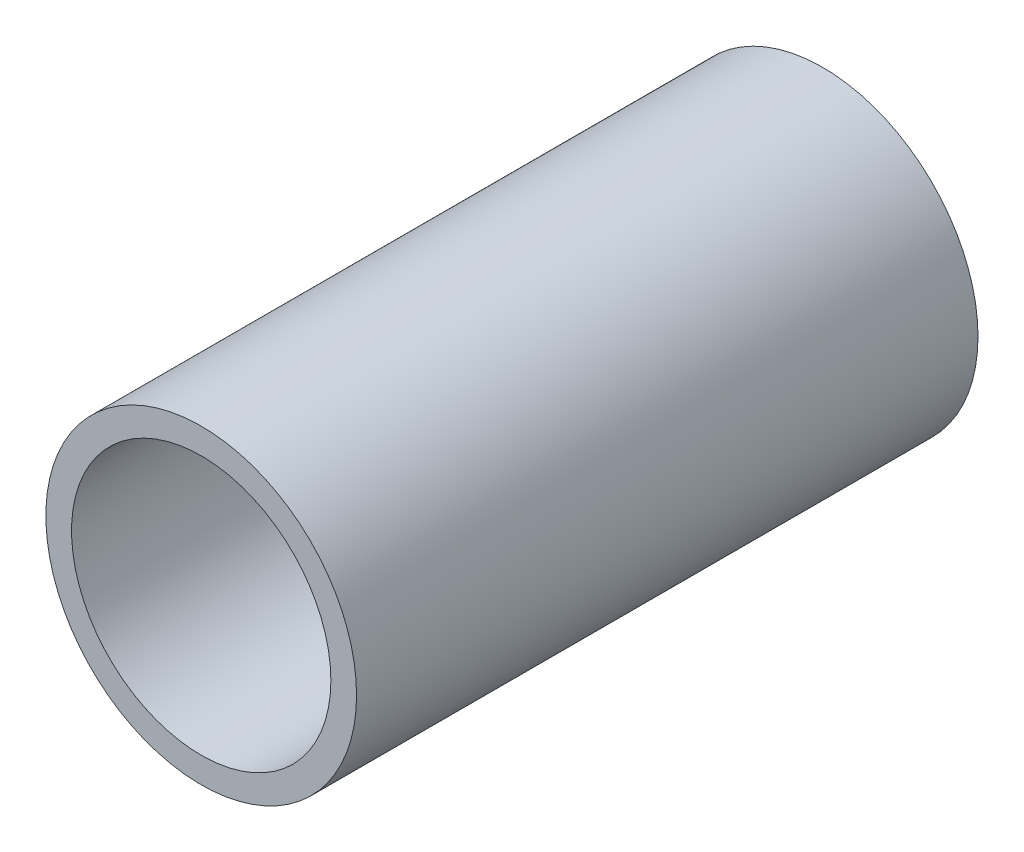
ISO-10303-21;
HEADER;
FILE_DESCRIPTION(('STEP AP214'),'2;1');
FILE_NAME('part.step','',(''),(''),'','','');
FILE_SCHEMA(('AUTOMOTIVE_DESIGN { 1 0 10303 214 1 1 1 1 }'));
ENDSEC;
DATA;
#1=APPLICATION_CONTEXT('core data for automotive mechanical design processes');
#2=APPLICATION_PROTOCOL_DEFINITION('international standard','automotive_design',2000,#1);
#3=PRODUCT_CONTEXT('',#1,'mechanical');
#4=PRODUCT('Part','Part','',(#3));
#5=PRODUCT_RELATED_PRODUCT_CATEGORY('part','',(#4));
#6=PRODUCT_DEFINITION_FORMATION('','',#4);
#7=PRODUCT_DEFINITION_CONTEXT('part definition',#1,'design');
#8=PRODUCT_DEFINITION('design','',#6,#7);
#9=PRODUCT_DEFINITION_SHAPE('','',#8);
#10=(LENGTH_UNIT() NAMED_UNIT(*) SI_UNIT(.MILLI.,.METRE.));
#11=(NAMED_UNIT(*) PLANE_ANGLE_UNIT() SI_UNIT($,.RADIAN.));
#12=(NAMED_UNIT(*) SI_UNIT($,.STERADIAN.) SOLID_ANGLE_UNIT());
#13=UNCERTAINTY_MEASURE_WITH_UNIT(LENGTH_MEASURE(1.E-05),#10,'distance_accuracy_value','');
#14=(GEOMETRIC_REPRESENTATION_CONTEXT(3) GLOBAL_UNCERTAINTY_ASSIGNED_CONTEXT((#13)) GLOBAL_UNIT_ASSIGNED_CONTEXT((#10,
#11,#12)) REPRESENTATION_CONTEXT('',''));
#15=CARTESIAN_POINT('',(0.,0.,0.));
#16=DIRECTION('',(0.,0.,1.));
#17=DIRECTION('',(1.,0.,0.));
#18=AXIS2_PLACEMENT_3D('',#15,#16,#17);
#19=CARTESIAN_POINT('',(0.,0.,76.2));
#20=DIRECTION('',(0.,0.,1.));
#21=DIRECTION('',(1.,0.,0.));
#22=AXIS2_PLACEMENT_3D('',#19,#20,#21);
#23=PLANE('',#22);
#24=CARTESIAN_POINT('',(0.,0.,76.2));
#25=DIRECTION('',(0.,0.,1.));
#26=DIRECTION('',(1.,0.,0.));
#27=AXIS2_PLACEMENT_3D('',#24,#25,#26);
#28=CIRCLE('',#27,19.05);
#29=CARTESIAN_POINT('',(19.05,0.,76.2));
#30=VERTEX_POINT('',#29);
#31=EDGE_CURVE('E10',#30,#30,#28,.T.);
#32=ORIENTED_EDGE('',*,*,#31,.T.);
#33=EDGE_LOOP('',(#32));
#34=FACE_BOUND('',#33,.T.);
#35=CARTESIAN_POINT('',(0.,0.,76.2));
#36=DIRECTION('',(0.,0.,1.));
#37=DIRECTION('',(1.,0.,0.));
#38=AXIS2_PLACEMENT_3D('',#35,#36,#37);
#39=CIRCLE('',#38,15.9);
#40=CARTESIAN_POINT('',(15.9,0.,76.2));
#41=VERTEX_POINT('',#40);
#42=EDGE_CURVE('E40',#41,#41,#39,.T.);
#43=ORIENTED_EDGE('',*,*,#42,.F.);
#44=EDGE_LOOP('',(#43));
#45=FACE_BOUND('',#44,.T.);
#46=ADVANCED_FACE('F29',(#34,#45),#23,.T.);
#47=CARTESIAN_POINT('',(0.,0.,0.));
#48=DIRECTION('',(0.,0.,1.));
#49=DIRECTION('',(1.,0.,0.));
#50=AXIS2_PLACEMENT_3D('',#47,#48,#49);
#51=PLANE('',#50);
#52=CARTESIAN_POINT('',(0.,0.,0.));
#53=DIRECTION('',(0.,0.,1.));
#54=DIRECTION('',(1.,0.,0.));
#55=AXIS2_PLACEMENT_3D('',#52,#53,#54);
#56=CIRCLE('',#55,19.05);
#57=CARTESIAN_POINT('',(19.05,0.,0.));
#58=VERTEX_POINT('',#57);
#59=EDGE_CURVE('E33',#58,#58,#56,.T.);
#60=ORIENTED_EDGE('',*,*,#59,.F.);
#61=EDGE_LOOP('',(#60));
#62=FACE_BOUND('',#61,.T.);
#63=CARTESIAN_POINT('',(0.,0.,0.));
#64=DIRECTION('',(0.,0.,1.));
#65=DIRECTION('',(1.,0.,0.));
#66=AXIS2_PLACEMENT_3D('',#63,#64,#65);
#67=CIRCLE('',#66,15.9);
#68=CARTESIAN_POINT('',(15.9,0.,0.));
#69=VERTEX_POINT('',#68);
#70=EDGE_CURVE('E42',#69,#69,#67,.T.);
#71=ORIENTED_EDGE('',*,*,#70,.T.);
#72=EDGE_LOOP('',(#71));
#73=FACE_BOUND('',#72,.T.);
#74=ADVANCED_FACE('F52',(#62,#73),#51,.F.);
#75=CARTESIAN_POINT('',(0.,0.,76.2));
#76=DIRECTION('',(0.,0.,-1.));
#77=DIRECTION('',(-1.,0.,0.));
#78=AXIS2_PLACEMENT_3D('',#75,#76,#77);
#79=CYLINDRICAL_SURFACE('',#78,19.05);
#80=ORIENTED_EDGE('',*,*,#31,.F.);
#81=EDGE_LOOP('',(#80));
#82=FACE_BOUND('',#81,.T.);
#83=ORIENTED_EDGE('',*,*,#59,.T.);
#84=EDGE_LOOP('',(#83));
#85=FACE_BOUND('',#84,.T.);
#86=ADVANCED_FACE('F31',(#82,#85),#79,.T.);
#87=CARTESIAN_POINT('',(0.,0.,76.2));
#88=DIRECTION('',(0.,0.,-1.));
#89=DIRECTION('',(-1.,0.,0.));
#90=AXIS2_PLACEMENT_3D('',#87,#88,#89);
#91=CYLINDRICAL_SURFACE('',#90,15.9);
#92=ORIENTED_EDGE('',*,*,#42,.T.);
#93=EDGE_LOOP('',(#92));
#94=FACE_BOUND('',#93,.T.);
#95=ORIENTED_EDGE('',*,*,#70,.F.);
#96=EDGE_LOOP('',(#95));
#97=FACE_BOUND('',#96,.T.);
#98=ADVANCED_FACE('F48',(#94,#97),#91,.F.);
#99=CLOSED_SHELL('',(#46,#74,#86,#98));
#100=MANIFOLD_SOLID_BREP('B2',#99);
#101=ADVANCED_BREP_SHAPE_REPRESENTATION('',(#18,#100),#14);
#102=SHAPE_DEFINITION_REPRESENTATION(#9,#101);
ENDSEC;
END-ISO-10303-21;
